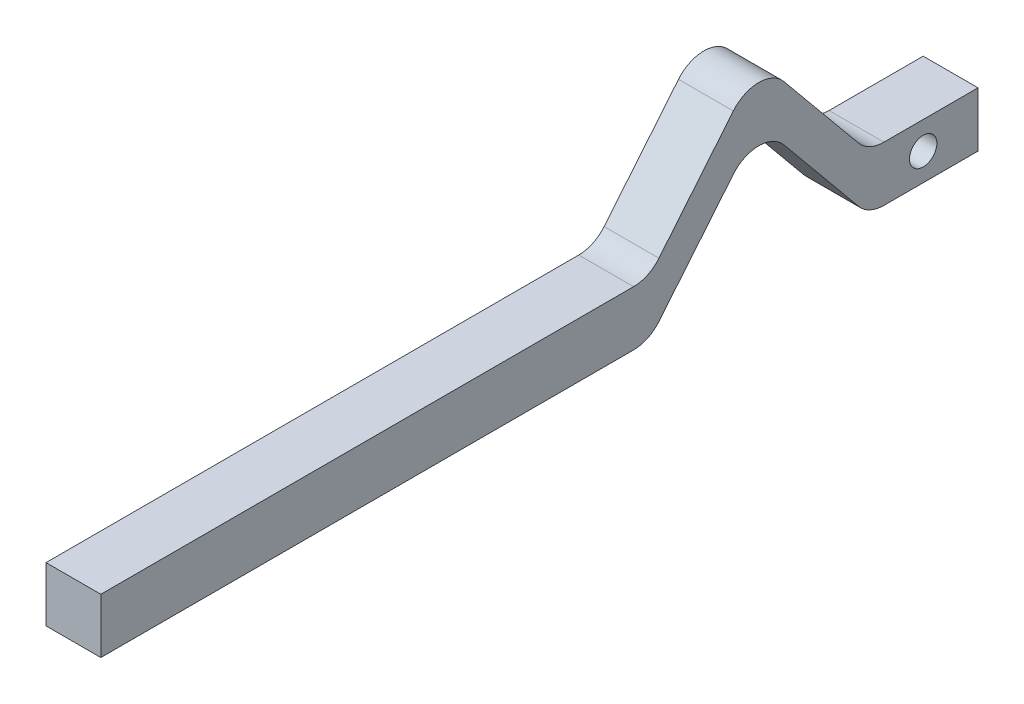
ISO-10303-21;
HEADER;
FILE_DESCRIPTION(('STEP AP214'),'2;1');
FILE_NAME('part.step','',(''),(''),'','','');
FILE_SCHEMA(('AUTOMOTIVE_DESIGN { 1 0 10303 214 1 1 1 1 }'));
ENDSEC;
DATA;
#1=APPLICATION_CONTEXT('core data for automotive mechanical design processes');
#2=APPLICATION_PROTOCOL_DEFINITION('international standard','automotive_design',2000,#1);
#3=PRODUCT_CONTEXT('',#1,'mechanical');
#4=PRODUCT('Part','Part','',(#3));
#5=PRODUCT_RELATED_PRODUCT_CATEGORY('part','',(#4));
#6=PRODUCT_DEFINITION_FORMATION('','',#4);
#7=PRODUCT_DEFINITION_CONTEXT('part definition',#1,'design');
#8=PRODUCT_DEFINITION('design','',#6,#7);
#9=PRODUCT_DEFINITION_SHAPE('','',#8);
#10=(LENGTH_UNIT() NAMED_UNIT(*) SI_UNIT(.MILLI.,.METRE.));
#11=(NAMED_UNIT(*) PLANE_ANGLE_UNIT() SI_UNIT($,.RADIAN.));
#12=(NAMED_UNIT(*) SI_UNIT($,.STERADIAN.) SOLID_ANGLE_UNIT());
#13=UNCERTAINTY_MEASURE_WITH_UNIT(LENGTH_MEASURE(1.E-05),#10,'distance_accuracy_value','');
#14=(GEOMETRIC_REPRESENTATION_CONTEXT(3) GLOBAL_UNCERTAINTY_ASSIGNED_CONTEXT((#13)) GLOBAL_UNIT_ASSIGNED_CONTEXT((#10,
#11,#12)) REPRESENTATION_CONTEXT('',''));
#15=CARTESIAN_POINT('',(0.,0.,0.));
#16=DIRECTION('',(0.,0.,1.));
#17=DIRECTION('',(1.,0.,0.));
#18=AXIS2_PLACEMENT_3D('',#15,#16,#17);
#19=CARTESIAN_POINT('',(6.35,6.35,0.));
#20=DIRECTION('',(0.,1.,0.));
#21=DIRECTION('',(0.,0.,1.));
#22=AXIS2_PLACEMENT_3D('',#19,#20,#21);
#23=PLANE('',#22);
#24=DIRECTION('',(0.,0.,-1.));
#25=VECTOR('',#24,1.);
#26=CARTESIAN_POINT('',(-6.35,6.35,0.));
#27=LINE('',#26,#25);
#28=CARTESIAN_POINT('',(-6.35,6.35,-79.7949544888901));
#29=VERTEX_POINT('',#28);
#30=CARTESIAN_POINT('',(-6.35,6.35,-101.6));
#31=VERTEX_POINT('',#30);
#32=EDGE_CURVE('E206',#29,#31,#27,.T.);
#33=ORIENTED_EDGE('',*,*,#32,.F.);
#34=DIRECTION('',(-1.,0.,0.));
#35=VECTOR('',#34,1.);
#36=CARTESIAN_POINT('',(6.35,6.35,-79.7949544888901));
#37=LINE('',#36,#35);
#38=CARTESIAN_POINT('',(6.35,6.35,-79.7949544888901));
#39=VERTEX_POINT('',#38);
#40=EDGE_CURVE('E294',#29,#39,#37,.F.);
#41=ORIENTED_EDGE('',*,*,#40,.T.);
#42=DIRECTION('',(0.,0.,-1.));
#43=VECTOR('',#42,1.);
#44=CARTESIAN_POINT('',(6.35,6.35,0.));
#45=LINE('',#44,#43);
#46=CARTESIAN_POINT('',(6.35,6.35,-101.6));
#47=VERTEX_POINT('',#46);
#48=EDGE_CURVE('E241',#39,#47,#45,.T.);
#49=ORIENTED_EDGE('',*,*,#48,.T.);
#50=DIRECTION('',(-1.,0.,0.));
#51=VECTOR('',#50,1.);
#52=CARTESIAN_POINT('',(6.35,6.35,-101.6));
#53=LINE('',#52,#51);
#54=EDGE_CURVE('E205',#47,#31,#53,.T.);
#55=ORIENTED_EDGE('',*,*,#54,.T.);
#56=EDGE_LOOP('',(#33,#41,#49,#55));
#57=FACE_BOUND('',#56,.T.);
#58=ADVANCED_FACE('F42',(#57),#23,.T.);
#59=CARTESIAN_POINT('',(6.35,39.964136826154,-48.504327781578));
#60=DIRECTION('',(0.,-0.635891137194442,0.771778764697215));
#61=DIRECTION('',(0.,-0.771778764697215,-0.635891137194442));
#62=AXIS2_PLACEMENT_3D('',#59,#60,#61);
#63=PLANE('',#62);
#64=DIRECTION('',(0.,0.771778764697215,0.635891137194442));
#65=VECTOR('',#64,1.);
#66=CARTESIAN_POINT('',(6.35,39.964136826154,-48.504327781578));
#67=LINE('',#66,#65);
#68=CARTESIAN_POINT('',(6.35,9.12450953457834,-73.9140003018973));
#69=VERTEX_POINT('',#68);
#70=CARTESIAN_POINT('',(6.35,30.0401950420245,-56.6809541869927));
#71=VERTEX_POINT('',#70);
#72=EDGE_CURVE('E374',#69,#71,#67,.T.);
#73=ORIENTED_EDGE('',*,*,#72,.F.);
#74=DIRECTION('',(-1.,0.,0.));
#75=VECTOR('',#74,1.);
#76=CARTESIAN_POINT('',(6.35,9.12450953457835,-73.9140003018973));
#77=LINE('',#76,#75);
#78=CARTESIAN_POINT('',(-6.35,9.12450953457834,-73.9140003018973));
#79=VERTEX_POINT('',#78);
#80=EDGE_CURVE('E290',#69,#79,#77,.T.);
#81=ORIENTED_EDGE('',*,*,#80,.T.);
#82=DIRECTION('',(0.,0.771778764697215,0.635891137194442));
#83=VECTOR('',#82,1.);
#84=CARTESIAN_POINT('',(-6.35,39.964136826154,-48.504327781578));
#85=LINE('',#84,#83);
#86=CARTESIAN_POINT('',(-6.35,30.0401950420245,-56.6809541869927));
#87=VERTEX_POINT('',#86);
#88=EDGE_CURVE('E209',#79,#87,#85,.T.);
#89=ORIENTED_EDGE('',*,*,#88,.T.);
#90=DIRECTION('',(-1.,0.,0.));
#91=VECTOR('',#90,1.);
#92=CARTESIAN_POINT('',(6.35,30.0401950420245,-56.6809541869927));
#93=LINE('',#92,#91);
#94=EDGE_CURVE('E287',#87,#71,#93,.F.);
#95=ORIENTED_EDGE('',*,*,#94,.T.);
#96=EDGE_LOOP('',(#73,#81,#89,#95));
#97=FACE_BOUND('',#96,.T.);
#98=ADVANCED_FACE('F341',(#97),#63,.F.);
#99=CARTESIAN_POINT('',(6.35,-9.89781845058264,-12.0129463207979));
#100=DIRECTION('',(0.,0.635891137194442,0.771778764697215));
#101=DIRECTION('',(0.,-0.771778764697215,0.635891137194442));
#102=AXIS2_PLACEMENT_3D('',#99,#100,#101);
#103=PLANE('',#102);
#104=DIRECTION('',(0.,0.771778764697215,-0.635891137194442));
#105=VECTOR('',#104,1.);
#106=CARTESIAN_POINT('',(6.35,-9.89781845058264,-12.0129463207979));
#107=LINE('',#106,#105);
#108=CARTESIAN_POINT('',(6.35,9.12450953457835,-27.6859996981026));
#109=VERTEX_POINT('',#108);
#110=CARTESIAN_POINT('',(6.35,30.0401950420245,-44.9190458130072));
#111=VERTEX_POINT('',#110);
#112=EDGE_CURVE('E180',#109,#111,#107,.T.);
#113=ORIENTED_EDGE('',*,*,#112,.T.);
#114=DIRECTION('',(-1.,0.,0.));
#115=VECTOR('',#114,1.);
#116=CARTESIAN_POINT('',(-6.35,30.0401950420245,-44.9190458130072));
#117=LINE('',#116,#115);
#118=CARTESIAN_POINT('',(-6.35,30.0401950420245,-44.9190458130072));
#119=VERTEX_POINT('',#118);
#120=EDGE_CURVE('E300',#111,#119,#117,.T.);
#121=ORIENTED_EDGE('',*,*,#120,.T.);
#122=DIRECTION('',(0.,0.771778764697215,-0.635891137194442));
#123=VECTOR('',#122,1.);
#124=CARTESIAN_POINT('',(-6.35,-9.89781845058264,-12.0129463207979));
#125=LINE('',#124,#123);
#126=CARTESIAN_POINT('',(-6.35,9.12450953457835,-27.6859996981026));
#127=VERTEX_POINT('',#126);
#128=EDGE_CURVE('E214',#127,#119,#125,.T.);
#129=ORIENTED_EDGE('',*,*,#128,.F.);
#130=DIRECTION('',(-1.,0.,0.));
#131=VECTOR('',#130,1.);
#132=CARTESIAN_POINT('',(6.35,9.12450953457835,-27.6859996981025));
#133=LINE('',#132,#131);
#134=EDGE_CURVE('E297',#127,#109,#133,.F.);
#135=ORIENTED_EDGE('',*,*,#134,.T.);
#136=EDGE_LOOP('',(#113,#121,#129,#135));
#137=FACE_BOUND('',#136,.T.);
#138=ADVANCED_FACE('F327',(#137),#103,.T.);
#139=CARTESIAN_POINT('',(6.35,6.35,0.));
#140=DIRECTION('',(0.,1.,0.));
#141=DIRECTION('',(0.,0.,1.));
#142=AXIS2_PLACEMENT_3D('',#139,#140,#141);
#143=PLANE('',#142);
#144=DIRECTION('',(0.,0.,-1.));
#145=VECTOR('',#144,1.);
#146=CARTESIAN_POINT('',(6.35,6.35,0.));
#147=LINE('',#146,#145);
#148=CARTESIAN_POINT('',(6.35,6.35,101.6));
#149=VERTEX_POINT('',#148);
#150=CARTESIAN_POINT('',(6.35,6.35,-21.8050455111098));
#151=VERTEX_POINT('',#150);
#152=EDGE_CURVE('E161',#149,#151,#147,.T.);
#153=ORIENTED_EDGE('',*,*,#152,.T.);
#154=DIRECTION('',(-1.,0.,0.));
#155=VECTOR('',#154,1.);
#156=CARTESIAN_POINT('',(-6.35,6.35,-21.8050455111098));
#157=LINE('',#156,#155);
#158=CARTESIAN_POINT('',(-6.35,6.35,-21.8050455111098));
#159=VERTEX_POINT('',#158);
#160=EDGE_CURVE('E304',#151,#159,#157,.T.);
#161=ORIENTED_EDGE('',*,*,#160,.T.);
#162=DIRECTION('',(0.,0.,-1.));
#163=VECTOR('',#162,1.);
#164=CARTESIAN_POINT('',(-6.35,6.35,0.));
#165=LINE('',#164,#163);
#166=CARTESIAN_POINT('',(-6.35,6.35,101.6));
#167=VERTEX_POINT('',#166);
#168=EDGE_CURVE('E164',#167,#159,#165,.T.);
#169=ORIENTED_EDGE('',*,*,#168,.F.);
#170=DIRECTION('',(-1.,0.,0.));
#171=VECTOR('',#170,1.);
#172=CARTESIAN_POINT('',(6.35,6.35,101.6));
#173=LINE('',#172,#171);
#174=EDGE_CURVE('E157',#149,#167,#173,.T.);
#175=ORIENTED_EDGE('',*,*,#174,.F.);
#176=EDGE_LOOP('',(#153,#161,#169,#175));
#177=FACE_BOUND('',#176,.T.);
#178=ADVANCED_FACE('F159',(#177),#143,.T.);
#179=CARTESIAN_POINT('',(6.35,0.,101.6));
#180=DIRECTION('',(0.,0.,1.));
#181=DIRECTION('',(1.,0.,0.));
#182=AXIS2_PLACEMENT_3D('',#179,#180,#181);
#183=PLANE('',#182);
#184=DIRECTION('',(0.,1.,0.));
#185=VECTOR('',#184,1.);
#186=CARTESIAN_POINT('',(-6.35,0.,101.6));
#187=LINE('',#186,#185);
#188=CARTESIAN_POINT('',(-6.35,-6.35,101.6));
#189=VERTEX_POINT('',#188);
#190=EDGE_CURVE('E220',#189,#167,#187,.T.);
#191=ORIENTED_EDGE('',*,*,#190,.F.);
#192=DIRECTION('',(-1.,0.,0.));
#193=VECTOR('',#192,1.);
#194=CARTESIAN_POINT('',(6.35,-6.35,101.6));
#195=LINE('',#194,#193);
#196=CARTESIAN_POINT('',(6.35,-6.35,101.6));
#197=VERTEX_POINT('',#196);
#198=EDGE_CURVE('E171',#197,#189,#195,.T.);
#199=ORIENTED_EDGE('',*,*,#198,.F.);
#200=DIRECTION('',(0.,1.,0.));
#201=VECTOR('',#200,1.);
#202=CARTESIAN_POINT('',(6.35,0.,101.6));
#203=LINE('',#202,#201);
#204=EDGE_CURVE('E176',#197,#149,#203,.T.);
#205=ORIENTED_EDGE('',*,*,#204,.T.);
#206=ORIENTED_EDGE('',*,*,#174,.T.);
#207=EDGE_LOOP('',(#191,#199,#205,#206));
#208=FACE_BOUND('',#207,.T.);
#209=ADVANCED_FACE('F182',(#208),#183,.T.);
#210=CARTESIAN_POINT('',(6.35,-6.35,0.));
#211=DIRECTION('',(0.,1.,0.));
#212=DIRECTION('',(0.,0.,1.));
#213=AXIS2_PLACEMENT_3D('',#210,#211,#212);
#214=PLANE('',#213);
#215=DIRECTION('',(0.,0.,-1.));
#216=VECTOR('',#215,1.);
#217=CARTESIAN_POINT('',(-6.35,-6.35,0.));
#218=LINE('',#217,#216);
#219=CARTESIAN_POINT('',(-6.35,-6.35,-21.8050455111098));
#220=VERTEX_POINT('',#219);
#221=EDGE_CURVE('E223',#189,#220,#218,.T.);
#222=ORIENTED_EDGE('',*,*,#221,.T.);
#223=DIRECTION('',(-1.,0.,0.));
#224=VECTOR('',#223,1.);
#225=CARTESIAN_POINT('',(6.35,-6.35,-21.8050455111098));
#226=LINE('',#225,#224);
#227=CARTESIAN_POINT('',(6.35,-6.35,-21.8050455111098));
#228=VERTEX_POINT('',#227);
#229=EDGE_CURVE('E284',#220,#228,#226,.F.);
#230=ORIENTED_EDGE('',*,*,#229,.T.);
#231=DIRECTION('',(0.,0.,-1.));
#232=VECTOR('',#231,1.);
#233=CARTESIAN_POINT('',(6.35,-6.35,0.));
#234=LINE('',#233,#232);
#235=EDGE_CURVE('E185',#197,#228,#234,.T.);
#236=ORIENTED_EDGE('',*,*,#235,.F.);
#237=ORIENTED_EDGE('',*,*,#198,.T.);
#238=EDGE_LOOP('',(#222,#230,#236,#237));
#239=FACE_BOUND('',#238,.T.);
#240=ADVANCED_FACE('F417',(#239),#214,.F.);
#241=CARTESIAN_POINT('',(6.35,-15.0331591877856,-18.24569073039));
#242=DIRECTION('',(0.,0.635891137194442,0.771778764697215));
#243=DIRECTION('',(0.,-0.771778764697215,0.635891137194442));
#244=AXIS2_PLACEMENT_3D('',#241,#242,#243);
#245=PLANE('',#244);
#246=DIRECTION('',(0.,0.771778764697215,-0.635891137194442));
#247=VECTOR('',#246,1.);
#248=CARTESIAN_POINT('',(6.35,-15.0331591877856,-18.24569073039));
#249=LINE('',#248,#247);
#250=CARTESIAN_POINT('',(6.35,-3.57549046542165,-27.6859996981025));
#251=VERTEX_POINT('',#250);
#252=CARTESIAN_POINT('',(6.35,17.3401950420244,-44.9190458130072));
#253=VERTEX_POINT('',#252);
#254=EDGE_CURVE('E188',#251,#253,#249,.T.);
#255=ORIENTED_EDGE('',*,*,#254,.F.);
#256=DIRECTION('',(-1.,0.,0.));
#257=VECTOR('',#256,1.);
#258=CARTESIAN_POINT('',(6.35,-3.57549046542165,-27.6859996981025));
#259=LINE('',#258,#257);
#260=CARTESIAN_POINT('',(-6.35,-3.57549046542165,-27.6859996981025));
#261=VERTEX_POINT('',#260);
#262=EDGE_CURVE('E280',#251,#261,#259,.T.);
#263=ORIENTED_EDGE('',*,*,#262,.T.);
#264=DIRECTION('',(0.,0.771778764697215,-0.635891137194442));
#265=VECTOR('',#264,1.);
#266=CARTESIAN_POINT('',(-6.35,-15.0331591877856,-18.24569073039));
#267=LINE('',#266,#265);
#268=CARTESIAN_POINT('',(-6.35,17.3401950420244,-44.9190458130072));
#269=VERTEX_POINT('',#268);
#270=EDGE_CURVE('E227',#261,#269,#267,.T.);
#271=ORIENTED_EDGE('',*,*,#270,.T.);
#272=DIRECTION('',(-1.,0.,0.));
#273=VECTOR('',#272,1.);
#274=CARTESIAN_POINT('',(6.35,17.3401950420244,-44.9190458130072));
#275=LINE('',#274,#273);
#276=EDGE_CURVE('E58',#269,#253,#275,.F.);
#277=ORIENTED_EDGE('',*,*,#276,.T.);
#278=EDGE_LOOP('',(#255,#263,#271,#277));
#279=FACE_BOUND('',#278,.T.);
#280=ADVANCED_FACE('F413',(#279),#245,.F.);
#281=CARTESIAN_POINT('',(6.35,34.828796088951,-42.2715833719859));
#282=DIRECTION('',(0.,-0.635891137194442,0.771778764697215));
#283=DIRECTION('',(0.,-0.771778764697215,-0.635891137194442));
#284=AXIS2_PLACEMENT_3D('',#281,#282,#283);
#285=PLANE('',#284);
#286=DIRECTION('',(0.,0.771778764697215,0.635891137194442));
#287=VECTOR('',#286,1.);
#288=CARTESIAN_POINT('',(-6.35,34.828796088951,-42.2715833719859));
#289=LINE('',#288,#287);
#290=CARTESIAN_POINT('',(-6.35,-3.57549046542165,-73.9140003018973));
#291=VERTEX_POINT('',#290);
#292=CARTESIAN_POINT('',(-6.35,17.3401950420244,-56.6809541869927));
#293=VERTEX_POINT('',#292);
#294=EDGE_CURVE('E230',#291,#293,#289,.T.);
#295=ORIENTED_EDGE('',*,*,#294,.F.);
#296=DIRECTION('',(-1.,0.,0.));
#297=VECTOR('',#296,1.);
#298=CARTESIAN_POINT('',(6.35,-3.57549046542165,-73.9140003018973));
#299=LINE('',#298,#297);
#300=CARTESIAN_POINT('',(6.35,-3.57549046542165,-73.9140003018973));
#301=VERTEX_POINT('',#300);
#302=EDGE_CURVE('E267',#291,#301,#299,.F.);
#303=ORIENTED_EDGE('',*,*,#302,.T.);
#304=DIRECTION('',(0.,0.771778764697215,0.635891137194442));
#305=VECTOR('',#304,1.);
#306=CARTESIAN_POINT('',(6.35,34.828796088951,-42.2715833719859));
#307=LINE('',#306,#305);
#308=CARTESIAN_POINT('',(6.35,17.3401950420244,-56.6809541869927));
#309=VERTEX_POINT('',#308);
#310=EDGE_CURVE('E194',#301,#309,#307,.T.);
#311=ORIENTED_EDGE('',*,*,#310,.T.);
#312=DIRECTION('',(-1.,0.,0.));
#313=VECTOR('',#312,1.);
#314=CARTESIAN_POINT('',(6.35,17.3401950420244,-56.6809541869927));
#315=LINE('',#314,#313);
#316=EDGE_CURVE('E263',#309,#293,#315,.T.);
#317=ORIENTED_EDGE('',*,*,#316,.T.);
#318=EDGE_LOOP('',(#295,#303,#311,#317));
#319=FACE_BOUND('',#318,.T.);
#320=ADVANCED_FACE('F409',(#319),#285,.T.);
#321=CARTESIAN_POINT('',(6.35,-6.35,0.));
#322=DIRECTION('',(0.,1.,0.));
#323=DIRECTION('',(0.,0.,1.));
#324=AXIS2_PLACEMENT_3D('',#321,#322,#323);
#325=PLANE('',#324);
#326=DIRECTION('',(0.,0.,-1.));
#327=VECTOR('',#326,1.);
#328=CARTESIAN_POINT('',(6.35,-6.35,0.));
#329=LINE('',#328,#327);
#330=CARTESIAN_POINT('',(6.35,-6.35,-79.7949544888901));
#331=VERTEX_POINT('',#330);
#332=CARTESIAN_POINT('',(6.35,-6.35,-101.6));
#333=VERTEX_POINT('',#332);
#334=EDGE_CURVE('E198',#331,#333,#329,.T.);
#335=ORIENTED_EDGE('',*,*,#334,.F.);
#336=DIRECTION('',(-1.,0.,0.));
#337=VECTOR('',#336,1.);
#338=CARTESIAN_POINT('',(-6.35,-6.35,-79.7949544888901));
#339=LINE('',#338,#337);
#340=CARTESIAN_POINT('',(-6.35,-6.35,-79.7949544888901));
#341=VERTEX_POINT('',#340);
#342=EDGE_CURVE('E170',#331,#341,#339,.T.);
#343=ORIENTED_EDGE('',*,*,#342,.T.);
#344=DIRECTION('',(0.,0.,-1.));
#345=VECTOR('',#344,1.);
#346=CARTESIAN_POINT('',(-6.35,-6.35,0.));
#347=LINE('',#346,#345);
#348=CARTESIAN_POINT('',(-6.35,-6.35,-101.6));
#349=VERTEX_POINT('',#348);
#350=EDGE_CURVE('E234',#341,#349,#347,.T.);
#351=ORIENTED_EDGE('',*,*,#350,.T.);
#352=DIRECTION('',(-1.,0.,0.));
#353=VECTOR('',#352,1.);
#354=CARTESIAN_POINT('',(6.35,-6.35,-101.6));
#355=LINE('',#354,#353);
#356=EDGE_CURVE('E245',#333,#349,#355,.T.);
#357=ORIENTED_EDGE('',*,*,#356,.F.);
#358=EDGE_LOOP('',(#335,#343,#351,#357));
#359=FACE_BOUND('',#358,.T.);
#360=ADVANCED_FACE('F403',(#359),#325,.F.);
#361=CARTESIAN_POINT('',(6.35,0.,-101.6));
#362=DIRECTION('',(0.,0.,1.));
#363=DIRECTION('',(1.,0.,0.));
#364=AXIS2_PLACEMENT_3D('',#361,#362,#363);
#365=PLANE('',#364);
#366=DIRECTION('',(0.,1.,0.));
#367=VECTOR('',#366,1.);
#368=CARTESIAN_POINT('',(-6.35,0.,-101.6));
#369=LINE('',#368,#367);
#370=EDGE_CURVE('E237',#349,#31,#369,.T.);
#371=ORIENTED_EDGE('',*,*,#370,.T.);
#372=ORIENTED_EDGE('',*,*,#54,.F.);
#373=DIRECTION('',(0.,1.,0.));
#374=VECTOR('',#373,1.);
#375=CARTESIAN_POINT('',(6.35,0.,-101.6));
#376=LINE('',#375,#374);
#377=EDGE_CURVE('E201',#333,#47,#376,.T.);
#378=ORIENTED_EDGE('',*,*,#377,.F.);
#379=ORIENTED_EDGE('',*,*,#356,.T.);
#380=EDGE_LOOP('',(#371,#372,#378,#379));
#381=FACE_BOUND('',#380,.T.);
#382=ADVANCED_FACE('F396',(#381),#365,.F.);
#383=CARTESIAN_POINT('',(6.35,0.,0.));
#384=DIRECTION('',(1.,0.,0.));
#385=DIRECTION('',(0.,0.,-1.));
#386=AXIS2_PLACEMENT_3D('',#383,#384,#385);
#387=PLANE('',#386);
#388=CARTESIAN_POINT('',(6.35,0.,-88.9));
#389=DIRECTION('',(1.,0.,0.));
#390=DIRECTION('',(0.,0.,-1.));
#391=AXIS2_PLACEMENT_3D('',#388,#389,#390);
#392=CIRCLE('',#391,3.175);
#393=CARTESIAN_POINT('',(6.35,0.,-92.075));
#394=VERTEX_POINT('',#393);
#395=EDGE_CURVE('E384',#394,#394,#392,.T.);
#396=ORIENTED_EDGE('',*,*,#395,.F.);
#397=EDGE_LOOP('',(#396));
#398=FACE_BOUND('',#397,.T.);
#399=ORIENTED_EDGE('',*,*,#310,.F.);
#400=CARTESIAN_POINT('',(6.35,1.27,-79.7949544888901));
#401=DIRECTION('',(1.,0.,0.));
#402=DIRECTION('',(0.,0.,-1.));
#403=AXIS2_PLACEMENT_3D('',#400,#401,#402);
#404=CIRCLE('',#403,7.62);
#405=EDGE_CURVE('E275',#301,#331,#404,.T.);
#406=ORIENTED_EDGE('',*,*,#405,.T.);
#407=ORIENTED_EDGE('',*,*,#334,.T.);
#408=ORIENTED_EDGE('',*,*,#377,.T.);
#409=ORIENTED_EDGE('',*,*,#48,.F.);
#410=CARTESIAN_POINT('',(6.35,13.97,-79.7949544888901));
#411=DIRECTION('',(1.,0.,0.));
#412=DIRECTION('',(0.,0.,-1.));
#413=AXIS2_PLACEMENT_3D('',#410,#411,#412);
#414=CIRCLE('',#413,7.62);
#415=EDGE_CURVE('E316',#39,#69,#414,.F.);
#416=ORIENTED_EDGE('',*,*,#415,.T.);
#417=ORIENTED_EDGE('',*,*,#72,.T.);
#418=CARTESIAN_POINT('',(6.35,25.1947045766028,-50.7999999999999));
#419=DIRECTION('',(1.,0.,0.));
#420=DIRECTION('',(0.,0.,-1.));
#421=AXIS2_PLACEMENT_3D('',#418,#419,#420);
#422=CIRCLE('',#421,7.62);
#423=EDGE_CURVE('E270',#71,#111,#422,.T.);
#424=ORIENTED_EDGE('',*,*,#423,.T.);
#425=ORIENTED_EDGE('',*,*,#112,.F.);
#426=CARTESIAN_POINT('',(6.35,13.97,-21.8050455111098));
#427=DIRECTION('',(1.,0.,0.));
#428=DIRECTION('',(0.,0.,-1.));
#429=AXIS2_PLACEMENT_3D('',#426,#427,#428);
#430=CIRCLE('',#429,7.62);
#431=EDGE_CURVE('E11',#109,#151,#430,.F.);
#432=ORIENTED_EDGE('',*,*,#431,.T.);
#433=ORIENTED_EDGE('',*,*,#152,.F.);
#434=ORIENTED_EDGE('',*,*,#204,.F.);
#435=ORIENTED_EDGE('',*,*,#235,.T.);
#436=CARTESIAN_POINT('',(6.35,1.27,-21.8050455111098));
#437=DIRECTION('',(1.,0.,0.));
#438=DIRECTION('',(0.,0.,-1.));
#439=AXIS2_PLACEMENT_3D('',#436,#437,#438);
#440=CIRCLE('',#439,7.62);
#441=EDGE_CURVE('E65',#228,#251,#440,.T.);
#442=ORIENTED_EDGE('',*,*,#441,.T.);
#443=ORIENTED_EDGE('',*,*,#254,.T.);
#444=CARTESIAN_POINT('',(6.35,12.4947045766028,-50.7999999999999));
#445=DIRECTION('',(1.,0.,0.));
#446=DIRECTION('',(0.,0.,-1.));
#447=AXIS2_PLACEMENT_3D('',#444,#445,#446);
#448=CIRCLE('',#447,7.62);
#449=EDGE_CURVE('E310',#253,#309,#448,.F.);
#450=ORIENTED_EDGE('',*,*,#449,.T.);
#451=EDGE_LOOP('',(#399,#406,#407,#408,#409,#416,#417,#424,#425,#432,#433,#434,#435,#442,#443,#450));
#452=FACE_BOUND('',#451,.T.);
#453=ADVANCED_FACE('F175',(#398,#452),#387,.T.);
#454=CARTESIAN_POINT('',(-6.35,0.,0.));
#455=DIRECTION('',(1.,0.,0.));
#456=DIRECTION('',(0.,0.,-1.));
#457=AXIS2_PLACEMENT_3D('',#454,#455,#456);
#458=PLANE('',#457);
#459=CARTESIAN_POINT('',(-6.35,0.,-88.9));
#460=DIRECTION('',(1.,0.,0.));
#461=DIRECTION('',(0.,0.,-1.));
#462=AXIS2_PLACEMENT_3D('',#459,#460,#461);
#463=CIRCLE('',#462,3.175);
#464=CARTESIAN_POINT('',(-6.35,0.,-92.075));
#465=VERTEX_POINT('',#464);
#466=EDGE_CURVE('E210',#465,#465,#463,.T.);
#467=ORIENTED_EDGE('',*,*,#466,.T.);
#468=EDGE_LOOP('',(#467));
#469=FACE_BOUND('',#468,.T.);
#470=ORIENTED_EDGE('',*,*,#350,.F.);
#471=CARTESIAN_POINT('',(-6.35,1.27,-79.7949544888901));
#472=DIRECTION('',(1.,0.,0.));
#473=DIRECTION('',(0.,0.,-1.));
#474=AXIS2_PLACEMENT_3D('',#471,#472,#473);
#475=CIRCLE('',#474,7.62);
#476=EDGE_CURVE('E260',#341,#291,#475,.F.);
#477=ORIENTED_EDGE('',*,*,#476,.T.);
#478=ORIENTED_EDGE('',*,*,#294,.T.);
#479=CARTESIAN_POINT('',(-6.35,12.4947045766028,-50.7999999999999));
#480=DIRECTION('',(1.,0.,0.));
#481=DIRECTION('',(0.,0.,-1.));
#482=AXIS2_PLACEMENT_3D('',#479,#480,#481);
#483=CIRCLE('',#482,7.62);
#484=EDGE_CURVE('E307',#293,#269,#483,.T.);
#485=ORIENTED_EDGE('',*,*,#484,.T.);
#486=ORIENTED_EDGE('',*,*,#270,.F.);
#487=CARTESIAN_POINT('',(-6.35,1.27,-21.8050455111098));
#488=DIRECTION('',(1.,0.,0.));
#489=DIRECTION('',(0.,0.,-1.));
#490=AXIS2_PLACEMENT_3D('',#487,#488,#489);
#491=CIRCLE('',#490,7.62);
#492=EDGE_CURVE('E257',#261,#220,#491,.F.);
#493=ORIENTED_EDGE('',*,*,#492,.T.);
#494=ORIENTED_EDGE('',*,*,#221,.F.);
#495=ORIENTED_EDGE('',*,*,#190,.T.);
#496=ORIENTED_EDGE('',*,*,#168,.T.);
#497=CARTESIAN_POINT('',(-6.35,13.97,-21.8050455111098));
#498=DIRECTION('',(1.,0.,0.));
#499=DIRECTION('',(0.,0.,-1.));
#500=AXIS2_PLACEMENT_3D('',#497,#498,#499);
#501=CIRCLE('',#500,7.62);
#502=EDGE_CURVE('E51',#159,#127,#501,.T.);
#503=ORIENTED_EDGE('',*,*,#502,.T.);
#504=ORIENTED_EDGE('',*,*,#128,.T.);
#505=CARTESIAN_POINT('',(-6.35,25.1947045766028,-50.7999999999999));
#506=DIRECTION('',(1.,0.,0.));
#507=DIRECTION('',(0.,0.,-1.));
#508=AXIS2_PLACEMENT_3D('',#505,#506,#507);
#509=CIRCLE('',#508,7.62);
#510=EDGE_CURVE('E254',#119,#87,#509,.F.);
#511=ORIENTED_EDGE('',*,*,#510,.T.);
#512=ORIENTED_EDGE('',*,*,#88,.F.);
#513=CARTESIAN_POINT('',(-6.35,13.97,-79.7949544888901));
#514=DIRECTION('',(1.,0.,0.));
#515=DIRECTION('',(0.,0.,-1.));
#516=AXIS2_PLACEMENT_3D('',#513,#514,#515);
#517=CIRCLE('',#516,7.62);
#518=EDGE_CURVE('E313',#79,#29,#517,.T.);
#519=ORIENTED_EDGE('',*,*,#518,.T.);
#520=ORIENTED_EDGE('',*,*,#32,.T.);
#521=ORIENTED_EDGE('',*,*,#370,.F.);
#522=EDGE_LOOP('',(#470,#477,#478,#485,#486,#493,#494,#495,#496,#503,#504,#511,#512,#519,#520,#521));
#523=FACE_BOUND('',#522,.T.);
#524=ADVANCED_FACE('F322',(#469,#523),#458,.F.);
#525=CARTESIAN_POINT('',(6.35,1.27,-79.7949544888901));
#526=DIRECTION('',(1.,0.,0.));
#527=DIRECTION('',(0.,0.,-1.));
#528=AXIS2_PLACEMENT_3D('',#525,#526,#527);
#529=CYLINDRICAL_SURFACE('',#528,7.62);
#530=ORIENTED_EDGE('',*,*,#405,.F.);
#531=ORIENTED_EDGE('',*,*,#302,.F.);
#532=ORIENTED_EDGE('',*,*,#476,.F.);
#533=ORIENTED_EDGE('',*,*,#342,.F.);
#534=EDGE_LOOP('',(#530,#531,#532,#533));
#535=FACE_BOUND('',#534,.T.);
#536=ADVANCED_FACE('F352',(#535),#529,.T.);
#537=CARTESIAN_POINT('',(6.35,1.27,-21.8050455111098));
#538=DIRECTION('',(-1.,0.,0.));
#539=DIRECTION('',(0.,0.,1.));
#540=AXIS2_PLACEMENT_3D('',#537,#538,#539);
#541=CYLINDRICAL_SURFACE('',#540,7.62);
#542=ORIENTED_EDGE('',*,*,#441,.F.);
#543=ORIENTED_EDGE('',*,*,#229,.F.);
#544=ORIENTED_EDGE('',*,*,#492,.F.);
#545=ORIENTED_EDGE('',*,*,#262,.F.);
#546=EDGE_LOOP('',(#542,#543,#544,#545));
#547=FACE_BOUND('',#546,.T.);
#548=ADVANCED_FACE('F355',(#547),#541,.T.);
#549=CARTESIAN_POINT('',(6.35,12.4947045766028,-50.7999999999999));
#550=DIRECTION('',(-1.,0.,0.));
#551=DIRECTION('',(0.,0.,1.));
#552=AXIS2_PLACEMENT_3D('',#549,#550,#551);
#553=CYLINDRICAL_SURFACE('',#552,7.62);
#554=ORIENTED_EDGE('',*,*,#449,.F.);
#555=ORIENTED_EDGE('',*,*,#276,.F.);
#556=ORIENTED_EDGE('',*,*,#484,.F.);
#557=ORIENTED_EDGE('',*,*,#316,.F.);
#558=EDGE_LOOP('',(#554,#555,#556,#557));
#559=FACE_BOUND('',#558,.T.);
#560=ADVANCED_FACE('F359',(#559),#553,.F.);
#561=CARTESIAN_POINT('',(6.35,13.97,-79.7949544888901));
#562=DIRECTION('',(-1.,0.,0.));
#563=DIRECTION('',(0.,0.,1.));
#564=AXIS2_PLACEMENT_3D('',#561,#562,#563);
#565=CYLINDRICAL_SURFACE('',#564,7.62);
#566=ORIENTED_EDGE('',*,*,#415,.F.);
#567=ORIENTED_EDGE('',*,*,#40,.F.);
#568=ORIENTED_EDGE('',*,*,#518,.F.);
#569=ORIENTED_EDGE('',*,*,#80,.F.);
#570=EDGE_LOOP('',(#566,#567,#568,#569));
#571=FACE_BOUND('',#570,.T.);
#572=ADVANCED_FACE('F338',(#571),#565,.F.);
#573=CARTESIAN_POINT('',(6.35,25.1947045766028,-50.7999999999999));
#574=DIRECTION('',(1.,0.,0.));
#575=DIRECTION('',(0.,0.,-1.));
#576=AXIS2_PLACEMENT_3D('',#573,#574,#575);
#577=CYLINDRICAL_SURFACE('',#576,7.62);
#578=ORIENTED_EDGE('',*,*,#423,.F.);
#579=ORIENTED_EDGE('',*,*,#94,.F.);
#580=ORIENTED_EDGE('',*,*,#510,.F.);
#581=ORIENTED_EDGE('',*,*,#120,.F.);
#582=EDGE_LOOP('',(#578,#579,#580,#581));
#583=FACE_BOUND('',#582,.T.);
#584=ADVANCED_FACE('F331',(#583),#577,.T.);
#585=CARTESIAN_POINT('',(6.35,13.97,-21.8050455111098));
#586=DIRECTION('',(1.,0.,0.));
#587=DIRECTION('',(0.,0.,-1.));
#588=AXIS2_PLACEMENT_3D('',#585,#586,#587);
#589=CYLINDRICAL_SURFACE('',#588,7.62);
#590=ORIENTED_EDGE('',*,*,#431,.F.);
#591=ORIENTED_EDGE('',*,*,#134,.F.);
#592=ORIENTED_EDGE('',*,*,#502,.F.);
#593=ORIENTED_EDGE('',*,*,#160,.F.);
#594=EDGE_LOOP('',(#590,#591,#592,#593));
#595=FACE_BOUND('',#594,.T.);
#596=ADVANCED_FACE('F44',(#595),#589,.F.);
#597=CARTESIAN_POINT('',(-6.35,0.,-88.9));
#598=DIRECTION('',(1.,0.,0.));
#599=DIRECTION('',(0.,0.,-1.));
#600=AXIS2_PLACEMENT_3D('',#597,#598,#599);
#601=CYLINDRICAL_SURFACE('',#600,3.175);
#602=ORIENTED_EDGE('',*,*,#466,.F.);
#603=EDGE_LOOP('',(#602));
#604=FACE_BOUND('',#603,.T.);
#605=ORIENTED_EDGE('',*,*,#395,.T.);
#606=EDGE_LOOP('',(#605));
#607=FACE_BOUND('',#606,.T.);
#608=ADVANCED_FACE('F330',(#604,#607),#601,.F.);
#609=CLOSED_SHELL('',(#58,#98,#138,#178,#209,#240,#280,#320,#360,#382,#453,#524,#536,#548,#560,
#572,#584,#596,#608));
#610=MANIFOLD_SOLID_BREP('B2',#609);
#611=ADVANCED_BREP_SHAPE_REPRESENTATION('',(#18,#610),#14);
#612=SHAPE_DEFINITION_REPRESENTATION(#9,#611);
ENDSEC;
END-ISO-10303-21;
